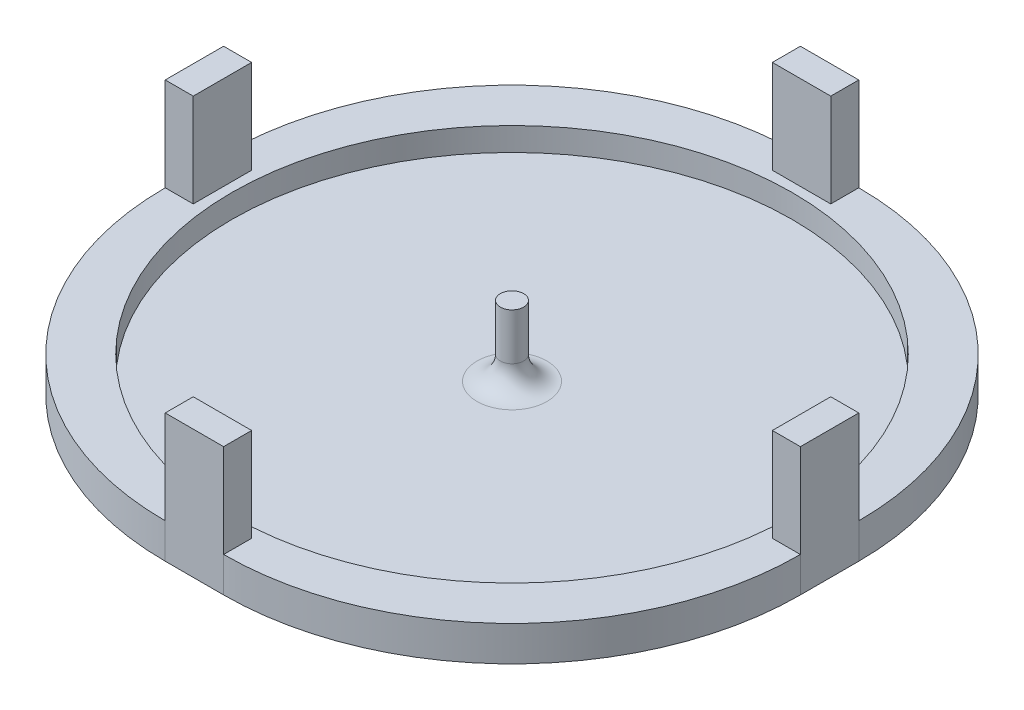
ISO-10303-21;
HEADER;
FILE_DESCRIPTION(('STEP AP214'),'2;1');
FILE_NAME('part.step','',(''),(''),'','','');
FILE_SCHEMA(('AUTOMOTIVE_DESIGN { 1 0 10303 214 1 1 1 1 }'));
ENDSEC;
DATA;
#1=APPLICATION_CONTEXT('core data for automotive mechanical design processes');
#2=APPLICATION_PROTOCOL_DEFINITION('international standard','automotive_design',2000,#1);
#3=PRODUCT_CONTEXT('',#1,'mechanical');
#4=PRODUCT('Part','Part','',(#3));
#5=PRODUCT_RELATED_PRODUCT_CATEGORY('part','',(#4));
#6=PRODUCT_DEFINITION_FORMATION('','',#4);
#7=PRODUCT_DEFINITION_CONTEXT('part definition',#1,'design');
#8=PRODUCT_DEFINITION('design','',#6,#7);
#9=PRODUCT_DEFINITION_SHAPE('','',#8);
#10=(LENGTH_UNIT() NAMED_UNIT(*) SI_UNIT(.MILLI.,.METRE.));
#11=(NAMED_UNIT(*) PLANE_ANGLE_UNIT() SI_UNIT($,.RADIAN.));
#12=(NAMED_UNIT(*) SI_UNIT($,.STERADIAN.) SOLID_ANGLE_UNIT());
#13=UNCERTAINTY_MEASURE_WITH_UNIT(LENGTH_MEASURE(1.E-05),#10,'distance_accuracy_value','');
#14=(GEOMETRIC_REPRESENTATION_CONTEXT(3) GLOBAL_UNCERTAINTY_ASSIGNED_CONTEXT((#13)) GLOBAL_UNIT_ASSIGNED_CONTEXT((#10,
#11,#12)) REPRESENTATION_CONTEXT('',''));
#15=CARTESIAN_POINT('',(0.,0.,0.));
#16=DIRECTION('',(0.,0.,1.));
#17=DIRECTION('',(1.,0.,0.));
#18=AXIS2_PLACEMENT_3D('',#15,#16,#17);
#19=CARTESIAN_POINT('',(-12.4,5.5,-1.3766765505352E-13));
#20=DIRECTION('',(1.,0.,0.));
#21=DIRECTION('',(0.,0.,-1.));
#22=AXIS2_PLACEMENT_3D('',#19,#20,#21);
#23=PLANE('',#22);
#24=DIRECTION('',(0.,0.,1.));
#25=VECTOR('',#24,1.);
#26=CARTESIAN_POINT('',(-12.4,1.5,-1.3766765505352E-13));
#27=LINE('',#26,#25);
#28=CARTESIAN_POINT('',(-12.4,1.5,-1.25));
#29=VERTEX_POINT('',#28);
#30=CARTESIAN_POINT('',(-12.4,1.5,1.25));
#31=VERTEX_POINT('',#30);
#32=EDGE_CURVE('E63',#29,#31,#27,.T.);
#33=ORIENTED_EDGE('',*,*,#32,.F.);
#34=DIRECTION('',(0.,-1.,0.));
#35=VECTOR('',#34,1.);
#36=CARTESIAN_POINT('',(-12.4,5.5,-1.25));
#37=LINE('',#36,#35);
#38=CARTESIAN_POINT('',(-12.4,5.5,-1.25));
#39=VERTEX_POINT('',#38);
#40=EDGE_CURVE('E429',#39,#29,#37,.T.);
#41=ORIENTED_EDGE('',*,*,#40,.F.);
#42=DIRECTION('',(0.,0.,1.));
#43=VECTOR('',#42,1.);
#44=CARTESIAN_POINT('',(-12.4,5.5,-1.3766765505352E-13));
#45=LINE('',#44,#43);
#46=CARTESIAN_POINT('',(-12.4,5.5,1.25));
#47=VERTEX_POINT('',#46);
#48=EDGE_CURVE('E401',#39,#47,#45,.T.);
#49=ORIENTED_EDGE('',*,*,#48,.T.);
#50=DIRECTION('',(0.,-1.,0.));
#51=VECTOR('',#50,1.);
#52=CARTESIAN_POINT('',(-12.4,5.5,1.25));
#53=LINE('',#52,#51);
#54=EDGE_CURVE('E416',#47,#31,#53,.T.);
#55=ORIENTED_EDGE('',*,*,#54,.T.);
#56=EDGE_LOOP('',(#33,#41,#49,#55));
#57=FACE_BOUND('',#56,.T.);
#58=ADVANCED_FACE('F47',(#57),#23,.T.);
#59=CARTESIAN_POINT('',(0.,5.5,-1.25));
#60=DIRECTION('',(0.,0.,-1.));
#61=DIRECTION('',(-1.,0.,0.));
#62=AXIS2_PLACEMENT_3D('',#59,#60,#61);
#63=PLANE('',#62);
#64=DIRECTION('',(1.,0.,0.));
#65=VECTOR('',#64,1.);
#66=CARTESIAN_POINT('',(0.,1.5,-1.25));
#67=LINE('',#66,#65);
#68=CARTESIAN_POINT('',(-13.6,1.5,-1.25));
#69=VERTEX_POINT('',#68);
#70=EDGE_CURVE('E70',#69,#29,#67,.T.);
#71=ORIENTED_EDGE('',*,*,#70,.F.);
#72=DIRECTION('',(0.,-1.,0.));
#73=VECTOR('',#72,1.);
#74=CARTESIAN_POINT('',(-13.6,5.5,-1.25));
#75=LINE('',#74,#73);
#76=CARTESIAN_POINT('',(-13.6,5.5,-1.25));
#77=VERTEX_POINT('',#76);
#78=EDGE_CURVE('E426',#77,#69,#75,.T.);
#79=ORIENTED_EDGE('',*,*,#78,.F.);
#80=DIRECTION('',(1.,0.,0.));
#81=VECTOR('',#80,1.);
#82=CARTESIAN_POINT('',(0.,5.5,-1.25));
#83=LINE('',#82,#81);
#84=EDGE_CURVE('E405',#77,#39,#83,.T.);
#85=ORIENTED_EDGE('',*,*,#84,.T.);
#86=ORIENTED_EDGE('',*,*,#40,.T.);
#87=EDGE_LOOP('',(#71,#79,#85,#86));
#88=FACE_BOUND('',#87,.T.);
#89=ADVANCED_FACE('F453',(#88),#63,.T.);
#90=CARTESIAN_POINT('',(-13.6,5.5,0.));
#91=DIRECTION('',(-1.,0.,0.));
#92=DIRECTION('',(0.,0.,1.));
#93=AXIS2_PLACEMENT_3D('',#90,#91,#92);
#94=PLANE('',#93);
#95=DIRECTION('',(0.,0.,-1.));
#96=VECTOR('',#95,1.);
#97=CARTESIAN_POINT('',(-13.6,0.,0.));
#98=LINE('',#97,#96);
#99=CARTESIAN_POINT('',(-13.6,0.,1.25));
#100=VERTEX_POINT('',#99);
#101=CARTESIAN_POINT('',(-13.6,0.,-1.25));
#102=VERTEX_POINT('',#101);
#103=EDGE_CURVE('E400',#100,#102,#98,.T.);
#104=ORIENTED_EDGE('',*,*,#103,.F.);
#105=DIRECTION('',(0.,-1.,0.));
#106=VECTOR('',#105,1.);
#107=CARTESIAN_POINT('',(-13.6,1.5,1.25));
#108=LINE('',#107,#106);
#109=CARTESIAN_POINT('',(-13.6,1.5,1.25));
#110=VERTEX_POINT('',#109);
#111=EDGE_CURVE('E382',#110,#100,#108,.T.);
#112=ORIENTED_EDGE('',*,*,#111,.F.);
#113=DIRECTION('',(0.,-1.,0.));
#114=VECTOR('',#113,1.);
#115=CARTESIAN_POINT('',(-13.6,5.5,1.25));
#116=LINE('',#115,#114);
#117=CARTESIAN_POINT('',(-13.6,5.5,1.25));
#118=VERTEX_POINT('',#117);
#119=EDGE_CURVE('E422',#118,#110,#116,.T.);
#120=ORIENTED_EDGE('',*,*,#119,.F.);
#121=DIRECTION('',(0.,0.,-1.));
#122=VECTOR('',#121,1.);
#123=CARTESIAN_POINT('',(-13.6,5.5,0.));
#124=LINE('',#123,#122);
#125=EDGE_CURVE('E409',#118,#77,#124,.T.);
#126=ORIENTED_EDGE('',*,*,#125,.T.);
#127=ORIENTED_EDGE('',*,*,#78,.T.);
#128=DIRECTION('',(0.,-1.,0.));
#129=VECTOR('',#128,1.);
#130=CARTESIAN_POINT('',(-13.6,1.5,-1.25));
#131=LINE('',#130,#129);
#132=EDGE_CURVE('E386',#69,#102,#131,.T.);
#133=ORIENTED_EDGE('',*,*,#132,.T.);
#134=EDGE_LOOP('',(#104,#112,#120,#126,#127,#133));
#135=FACE_BOUND('',#134,.T.);
#136=ADVANCED_FACE('F458',(#135),#94,.T.);
#137=CARTESIAN_POINT('',(0.,5.5,1.25));
#138=DIRECTION('',(0.,0.,-1.));
#139=DIRECTION('',(-1.,0.,0.));
#140=AXIS2_PLACEMENT_3D('',#137,#138,#139);
#141=PLANE('',#140);
#142=ORIENTED_EDGE('',*,*,#119,.T.);
#143=DIRECTION('',(1.,0.,0.));
#144=VECTOR('',#143,1.);
#145=CARTESIAN_POINT('',(0.,1.5,1.25));
#146=LINE('',#145,#144);
#147=EDGE_CURVE('E334',#110,#31,#146,.T.);
#148=ORIENTED_EDGE('',*,*,#147,.T.);
#149=ORIENTED_EDGE('',*,*,#54,.F.);
#150=DIRECTION('',(1.,0.,0.));
#151=VECTOR('',#150,1.);
#152=CARTESIAN_POINT('',(0.,5.5,1.25));
#153=LINE('',#152,#151);
#154=EDGE_CURVE('E413',#118,#47,#153,.T.);
#155=ORIENTED_EDGE('',*,*,#154,.F.);
#156=EDGE_LOOP('',(#142,#148,#149,#155));
#157=FACE_BOUND('',#156,.T.);
#158=ADVANCED_FACE('F463',(#157),#141,.F.);
#159=CARTESIAN_POINT('',(0.,5.5,0.));
#160=DIRECTION('',(0.,1.,0.));
#161=DIRECTION('',(0.,0.,1.));
#162=AXIS2_PLACEMENT_3D('',#159,#160,#161);
#163=PLANE('',#162);
#164=ORIENTED_EDGE('',*,*,#48,.F.);
#165=ORIENTED_EDGE('',*,*,#84,.F.);
#166=ORIENTED_EDGE('',*,*,#125,.F.);
#167=ORIENTED_EDGE('',*,*,#154,.T.);
#168=EDGE_LOOP('',(#164,#165,#166,#167));
#169=FACE_BOUND('',#168,.T.);
#170=ADVANCED_FACE('F467',(#169),#163,.T.);
#171=CARTESIAN_POINT('',(0.,0.,0.));
#172=DIRECTION('',(0.,1.,0.));
#173=DIRECTION('',(0.,0.,1.));
#174=AXIS2_PLACEMENT_3D('',#171,#172,#173);
#175=PLANE('',#174);
#176=DIRECTION('',(1.,0.,0.));
#177=VECTOR('',#176,1.);
#178=CARTESIAN_POINT('',(0.,0.,13.6));
#179=LINE('',#178,#177);
#180=CARTESIAN_POINT('',(-1.25,0.,13.6));
#181=VERTEX_POINT('',#180);
#182=CARTESIAN_POINT('',(1.25,0.,13.6));
#183=VERTEX_POINT('',#182);
#184=EDGE_CURVE('E214',#181,#183,#179,.T.);
#185=ORIENTED_EDGE('',*,*,#184,.F.);
#186=CARTESIAN_POINT('',(-1.25000000000003,0.,1.25000000000002));
#187=DIRECTION('',(0.,1.,0.));
#188=DIRECTION('',(0.,0.,1.));
#189=AXIS2_PLACEMENT_3D('',#186,#187,#188);
#190=CIRCLE('',#189,12.35);
#191=EDGE_CURVE('E366',#100,#181,#190,.T.);
#192=ORIENTED_EDGE('',*,*,#191,.F.);
#193=ORIENTED_EDGE('',*,*,#103,.T.);
#194=CARTESIAN_POINT('',(-1.24999999999999,0.,-1.24999999999999));
#195=DIRECTION('',(0.,1.,0.));
#196=DIRECTION('',(0.,0.,1.));
#197=AXIS2_PLACEMENT_3D('',#194,#195,#196);
#198=CIRCLE('',#197,12.35);
#199=CARTESIAN_POINT('',(-1.25,0.,-13.6));
#200=VERTEX_POINT('',#199);
#201=EDGE_CURVE('E362',#102,#200,#198,.F.);
#202=ORIENTED_EDGE('',*,*,#201,.T.);
#203=DIRECTION('',(1.,0.,0.));
#204=VECTOR('',#203,1.);
#205=CARTESIAN_POINT('',(0.,0.,-13.6));
#206=LINE('',#205,#204);
#207=CARTESIAN_POINT('',(1.24999999999999,0.,-13.6));
#208=VERTEX_POINT('',#207);
#209=EDGE_CURVE('E264',#200,#208,#206,.T.);
#210=ORIENTED_EDGE('',*,*,#209,.T.);
#211=CARTESIAN_POINT('',(1.24999999999997,0.,-1.24999999999996));
#212=DIRECTION('',(0.,1.,0.));
#213=DIRECTION('',(0.,0.,1.));
#214=AXIS2_PLACEMENT_3D('',#211,#212,#213);
#215=CIRCLE('',#214,12.35);
#216=CARTESIAN_POINT('',(13.6,0.,-1.25));
#217=VERTEX_POINT('',#216);
#218=EDGE_CURVE('E299',#208,#217,#215,.F.);
#219=ORIENTED_EDGE('',*,*,#218,.T.);
#220=DIRECTION('',(0.,0.,-1.));
#221=VECTOR('',#220,1.);
#222=CARTESIAN_POINT('',(13.6,0.,0.));
#223=LINE('',#222,#221);
#224=CARTESIAN_POINT('',(13.6,0.,1.25));
#225=VERTEX_POINT('',#224);
#226=EDGE_CURVE('E198',#225,#217,#223,.T.);
#227=ORIENTED_EDGE('',*,*,#226,.F.);
#228=CARTESIAN_POINT('',(1.24999999999999,0.,1.24999999999999));
#229=DIRECTION('',(0.,1.,0.));
#230=DIRECTION('',(0.,0.,1.));
#231=AXIS2_PLACEMENT_3D('',#228,#229,#230);
#232=CIRCLE('',#231,12.35);
#233=EDGE_CURVE('E304',#225,#183,#232,.F.);
#234=ORIENTED_EDGE('',*,*,#233,.T.);
#235=EDGE_LOOP('',(#185,#192,#193,#202,#210,#219,#227,#234));
#236=FACE_BOUND('',#235,.T.);
#237=ADVANCED_FACE('F469',(#236),#175,.F.);
#238=CARTESIAN_POINT('',(1.24999999999997,1.5,-1.24999999999996));
#239=DIRECTION('',(0.,-1.,0.));
#240=DIRECTION('',(0.,0.,-1.));
#241=AXIS2_PLACEMENT_3D('',#238,#239,#240);
#242=CYLINDRICAL_SURFACE('',#241,12.35);
#243=ORIENTED_EDGE('',*,*,#218,.F.);
#244=DIRECTION('',(0.,-1.,0.));
#245=VECTOR('',#244,1.);
#246=CARTESIAN_POINT('',(1.24999999999999,1.5,-13.6));
#247=LINE('',#246,#245);
#248=CARTESIAN_POINT('',(1.24999999999999,1.5,-13.6));
#249=VERTEX_POINT('',#248);
#250=EDGE_CURVE('E392',#249,#208,#247,.T.);
#251=ORIENTED_EDGE('',*,*,#250,.F.);
#252=CARTESIAN_POINT('',(1.24999999999997,1.5,-1.24999999999996));
#253=DIRECTION('',(0.,1.,0.));
#254=DIRECTION('',(0.,0.,1.));
#255=AXIS2_PLACEMENT_3D('',#252,#253,#254);
#256=CIRCLE('',#255,12.35);
#257=CARTESIAN_POINT('',(13.6,1.5,-1.25));
#258=VERTEX_POINT('',#257);
#259=EDGE_CURVE('E312',#249,#258,#256,.F.);
#260=ORIENTED_EDGE('',*,*,#259,.T.);
#261=DIRECTION('',(0.,-1.,0.));
#262=VECTOR('',#261,1.);
#263=CARTESIAN_POINT('',(13.6,1.5,-1.25));
#264=LINE('',#263,#262);
#265=EDGE_CURVE('E396',#258,#217,#264,.T.);
#266=ORIENTED_EDGE('',*,*,#265,.T.);
#267=EDGE_LOOP('',(#243,#251,#260,#266));
#268=FACE_BOUND('',#267,.T.);
#269=ADVANCED_FACE('F472',(#268),#242,.T.);
#270=CARTESIAN_POINT('',(-1.24999999999999,1.5,-1.24999999999999));
#271=DIRECTION('',(0.,-1.,0.));
#272=DIRECTION('',(0.,0.,-1.));
#273=AXIS2_PLACEMENT_3D('',#270,#271,#272);
#274=CYLINDRICAL_SURFACE('',#273,12.35);
#275=ORIENTED_EDGE('',*,*,#201,.F.);
#276=ORIENTED_EDGE('',*,*,#132,.F.);
#277=CARTESIAN_POINT('',(-1.24999999999999,1.5,-1.24999999999999));
#278=DIRECTION('',(0.,1.,0.));
#279=DIRECTION('',(0.,0.,1.));
#280=AXIS2_PLACEMENT_3D('',#277,#278,#279);
#281=CIRCLE('',#280,12.35);
#282=CARTESIAN_POINT('',(-1.25,1.5,-13.6));
#283=VERTEX_POINT('',#282);
#284=EDGE_CURVE('E326',#69,#283,#281,.F.);
#285=ORIENTED_EDGE('',*,*,#284,.T.);
#286=DIRECTION('',(0.,-1.,0.));
#287=VECTOR('',#286,1.);
#288=CARTESIAN_POINT('',(-1.25,1.5,-13.6));
#289=LINE('',#288,#287);
#290=EDGE_CURVE('E389',#283,#200,#289,.T.);
#291=ORIENTED_EDGE('',*,*,#290,.T.);
#292=EDGE_LOOP('',(#275,#276,#285,#291));
#293=FACE_BOUND('',#292,.T.);
#294=ADVANCED_FACE('F478',(#293),#274,.T.);
#295=CARTESIAN_POINT('',(-1.25000000000003,1.5,1.25000000000002));
#296=DIRECTION('',(0.,-1.,0.));
#297=DIRECTION('',(0.,0.,-1.));
#298=AXIS2_PLACEMENT_3D('',#295,#296,#297);
#299=CYLINDRICAL_SURFACE('',#298,12.35);
#300=ORIENTED_EDGE('',*,*,#191,.T.);
#301=DIRECTION('',(0.,-1.,0.));
#302=VECTOR('',#301,1.);
#303=CARTESIAN_POINT('',(-1.25,1.5,13.6));
#304=LINE('',#303,#302);
#305=CARTESIAN_POINT('',(-1.25,1.5,13.6));
#306=VERTEX_POINT('',#305);
#307=EDGE_CURVE('E379',#306,#181,#304,.T.);
#308=ORIENTED_EDGE('',*,*,#307,.F.);
#309=CARTESIAN_POINT('',(-1.25000000000003,1.5,1.25000000000002));
#310=DIRECTION('',(0.,1.,0.));
#311=DIRECTION('',(0.,0.,1.));
#312=AXIS2_PLACEMENT_3D('',#309,#310,#311);
#313=CIRCLE('',#312,12.35);
#314=EDGE_CURVE('E337',#110,#306,#313,.T.);
#315=ORIENTED_EDGE('',*,*,#314,.F.);
#316=ORIENTED_EDGE('',*,*,#111,.T.);
#317=EDGE_LOOP('',(#300,#308,#315,#316));
#318=FACE_BOUND('',#317,.T.);
#319=ADVANCED_FACE('F482',(#318),#299,.T.);
#320=CARTESIAN_POINT('',(1.24999999999999,1.5,1.24999999999999));
#321=DIRECTION('',(0.,-1.,0.));
#322=DIRECTION('',(0.,0.,-1.));
#323=AXIS2_PLACEMENT_3D('',#320,#321,#322);
#324=CYLINDRICAL_SURFACE('',#323,12.35);
#325=ORIENTED_EDGE('',*,*,#233,.F.);
#326=DIRECTION('',(0.,-1.,0.));
#327=VECTOR('',#326,1.);
#328=CARTESIAN_POINT('',(13.6,1.5,1.25));
#329=LINE('',#328,#327);
#330=CARTESIAN_POINT('',(13.6,1.5,1.25));
#331=VERTEX_POINT('',#330);
#332=EDGE_CURVE('E358',#331,#225,#329,.T.);
#333=ORIENTED_EDGE('',*,*,#332,.F.);
#334=CARTESIAN_POINT('',(1.24999999999999,1.5,1.24999999999999));
#335=DIRECTION('',(0.,1.,0.));
#336=DIRECTION('',(0.,0.,1.));
#337=AXIS2_PLACEMENT_3D('',#334,#335,#336);
#338=CIRCLE('',#337,12.35);
#339=CARTESIAN_POINT('',(1.25,1.5,13.6));
#340=VERTEX_POINT('',#339);
#341=EDGE_CURVE('E350',#331,#340,#338,.F.);
#342=ORIENTED_EDGE('',*,*,#341,.T.);
#343=DIRECTION('',(0.,-1.,0.));
#344=VECTOR('',#343,1.);
#345=CARTESIAN_POINT('',(1.25,1.5,13.6));
#346=LINE('',#345,#344);
#347=EDGE_CURVE('E375',#340,#183,#346,.T.);
#348=ORIENTED_EDGE('',*,*,#347,.T.);
#349=EDGE_LOOP('',(#325,#333,#342,#348));
#350=FACE_BOUND('',#349,.T.);
#351=ADVANCED_FACE('F486',(#350),#324,.T.);
#352=CARTESIAN_POINT('',(0.,1.5,0.));
#353=DIRECTION('',(0.,-1.,0.));
#354=DIRECTION('',(0.,0.,-1.));
#355=AXIS2_PLACEMENT_3D('',#352,#353,#354);
#356=CYLINDRICAL_SURFACE('',#355,12.);
#357=CARTESIAN_POINT('',(0.,0.5,0.));
#358=DIRECTION('',(0.,1.,0.));
#359=DIRECTION('',(0.,0.,1.));
#360=AXIS2_PLACEMENT_3D('',#357,#358,#359);
#361=CIRCLE('',#360,12.);
#362=CARTESIAN_POINT('',(0.,0.5,12.));
#363=VERTEX_POINT('',#362);
#364=EDGE_CURVE('E432',#363,#363,#361,.T.);
#365=ORIENTED_EDGE('',*,*,#364,.F.);
#366=EDGE_LOOP('',(#365));
#367=FACE_BOUND('',#366,.T.);
#368=CARTESIAN_POINT('',(0.,1.5,0.));
#369=DIRECTION('',(0.,1.,0.));
#370=DIRECTION('',(0.,0.,1.));
#371=AXIS2_PLACEMENT_3D('',#368,#369,#370);
#372=CIRCLE('',#371,12.);
#373=CARTESIAN_POINT('',(0.,1.5,12.));
#374=VERTEX_POINT('',#373);
#375=EDGE_CURVE('E354',#374,#374,#372,.T.);
#376=ORIENTED_EDGE('',*,*,#375,.T.);
#377=EDGE_LOOP('',(#376));
#378=FACE_BOUND('',#377,.T.);
#379=ADVANCED_FACE('F490',(#367,#378),#356,.F.);
#380=CARTESIAN_POINT('',(0.,1.5,0.));
#381=DIRECTION('',(0.,1.,0.));
#382=DIRECTION('',(0.,0.,1.));
#383=AXIS2_PLACEMENT_3D('',#380,#381,#382);
#384=PLANE('',#383);
#385=DIRECTION('',(1.,0.,0.));
#386=VECTOR('',#385,1.);
#387=CARTESIAN_POINT('',(0.,1.5,1.25));
#388=LINE('',#387,#386);
#389=CARTESIAN_POINT('',(12.4,1.5,1.25));
#390=VERTEX_POINT('',#389);
#391=EDGE_CURVE('E300',#390,#331,#388,.T.);
#392=ORIENTED_EDGE('',*,*,#391,.F.);
#393=DIRECTION('',(0.,0.,-1.));
#394=VECTOR('',#393,1.);
#395=CARTESIAN_POINT('',(12.4,1.5,0.));
#396=LINE('',#395,#394);
#397=CARTESIAN_POINT('',(12.4,1.5,-1.25));
#398=VERTEX_POINT('',#397);
#399=EDGE_CURVE('E303',#390,#398,#396,.T.);
#400=ORIENTED_EDGE('',*,*,#399,.T.);
#401=DIRECTION('',(1.,0.,0.));
#402=VECTOR('',#401,1.);
#403=CARTESIAN_POINT('',(0.,1.5,-1.25));
#404=LINE('',#403,#402);
#405=EDGE_CURVE('E308',#398,#258,#404,.T.);
#406=ORIENTED_EDGE('',*,*,#405,.T.);
#407=ORIENTED_EDGE('',*,*,#259,.F.);
#408=DIRECTION('',(0.,0.,1.));
#409=VECTOR('',#408,1.);
#410=CARTESIAN_POINT('',(1.24999999999999,1.5,0.));
#411=LINE('',#410,#409);
#412=CARTESIAN_POINT('',(1.24999999999999,1.5,-12.4));
#413=VERTEX_POINT('',#412);
#414=EDGE_CURVE('E316',#249,#413,#411,.T.);
#415=ORIENTED_EDGE('',*,*,#414,.T.);
#416=DIRECTION('',(-1.,0.,0.));
#417=VECTOR('',#416,1.);
#418=CARTESIAN_POINT('',(0.,1.5,-12.4));
#419=LINE('',#418,#417);
#420=CARTESIAN_POINT('',(-1.25,1.5,-12.4));
#421=VERTEX_POINT('',#420);
#422=EDGE_CURVE('E319',#413,#421,#419,.T.);
#423=ORIENTED_EDGE('',*,*,#422,.T.);
#424=DIRECTION('',(0.,0.,1.));
#425=VECTOR('',#424,1.);
#426=CARTESIAN_POINT('',(-1.25,1.5,0.));
#427=LINE('',#426,#425);
#428=EDGE_CURVE('E322',#283,#421,#427,.T.);
#429=ORIENTED_EDGE('',*,*,#428,.F.);
#430=ORIENTED_EDGE('',*,*,#284,.F.);
#431=ORIENTED_EDGE('',*,*,#70,.T.);
#432=ORIENTED_EDGE('',*,*,#32,.T.);
#433=ORIENTED_EDGE('',*,*,#147,.F.);
#434=ORIENTED_EDGE('',*,*,#314,.T.);
#435=DIRECTION('',(0.,0.,1.));
#436=VECTOR('',#435,1.);
#437=CARTESIAN_POINT('',(-1.25,1.5,0.));
#438=LINE('',#437,#436);
#439=CARTESIAN_POINT('',(-1.25,1.5,12.4));
#440=VERTEX_POINT('',#439);
#441=EDGE_CURVE('E341',#440,#306,#438,.T.);
#442=ORIENTED_EDGE('',*,*,#441,.F.);
#443=DIRECTION('',(1.,0.,0.));
#444=VECTOR('',#443,1.);
#445=CARTESIAN_POINT('',(0.,1.5,12.4));
#446=LINE('',#445,#444);
#447=CARTESIAN_POINT('',(1.25,1.5,12.4));
#448=VERTEX_POINT('',#447);
#449=EDGE_CURVE('E194',#440,#448,#446,.T.);
#450=ORIENTED_EDGE('',*,*,#449,.T.);
#451=DIRECTION('',(0.,0.,1.));
#452=VECTOR('',#451,1.);
#453=CARTESIAN_POINT('',(1.24999999999999,1.5,0.));
#454=LINE('',#453,#452);
#455=EDGE_CURVE('E346',#448,#340,#454,.T.);
#456=ORIENTED_EDGE('',*,*,#455,.T.);
#457=ORIENTED_EDGE('',*,*,#341,.F.);
#458=EDGE_LOOP('',(#392,#400,#406,#407,#415,#423,#429,#430,#431,#432,#433,#434,#442,#450,#456,#457));
#459=FACE_BOUND('',#458,.T.);
#460=ORIENTED_EDGE('',*,*,#375,.F.);
#461=EDGE_LOOP('',(#460));
#462=FACE_BOUND('',#461,.T.);
#463=ADVANCED_FACE('F494',(#459,#462),#384,.T.);
#464=CARTESIAN_POINT('',(0.,5.5,-12.4));
#465=DIRECTION('',(0.,0.,1.));
#466=DIRECTION('',(1.,0.,0.));
#467=AXIS2_PLACEMENT_3D('',#464,#465,#466);
#468=PLANE('',#467);
#469=DIRECTION('',(0.,-1.,0.));
#470=VECTOR('',#469,1.);
#471=CARTESIAN_POINT('',(-1.25,5.5,-12.4));
#472=LINE('',#471,#470);
#473=CARTESIAN_POINT('',(-1.25,5.5,-12.4));
#474=VERTEX_POINT('',#473);
#475=EDGE_CURVE('E280',#474,#421,#472,.T.);
#476=ORIENTED_EDGE('',*,*,#475,.T.);
#477=ORIENTED_EDGE('',*,*,#422,.F.);
#478=DIRECTION('',(0.,-1.,0.));
#479=VECTOR('',#478,1.);
#480=CARTESIAN_POINT('',(1.24999999999999,5.5,-12.4));
#481=LINE('',#480,#479);
#482=CARTESIAN_POINT('',(1.24999999999999,5.5,-12.4));
#483=VERTEX_POINT('',#482);
#484=EDGE_CURVE('E295',#483,#413,#481,.T.);
#485=ORIENTED_EDGE('',*,*,#484,.F.);
#486=DIRECTION('',(-1.,0.,0.));
#487=VECTOR('',#486,1.);
#488=CARTESIAN_POINT('',(0.,5.5,-12.4));
#489=LINE('',#488,#487);
#490=EDGE_CURVE('E265',#483,#474,#489,.T.);
#491=ORIENTED_EDGE('',*,*,#490,.T.);
#492=EDGE_LOOP('',(#476,#477,#485,#491));
#493=FACE_BOUND('',#492,.T.);
#494=ADVANCED_FACE('F498',(#493),#468,.T.);
#495=CARTESIAN_POINT('',(1.24999999999999,5.5,0.));
#496=DIRECTION('',(1.,0.,0.));
#497=DIRECTION('',(0.,0.,-1.));
#498=AXIS2_PLACEMENT_3D('',#495,#496,#497);
#499=PLANE('',#498);
#500=ORIENTED_EDGE('',*,*,#484,.T.);
#501=ORIENTED_EDGE('',*,*,#414,.F.);
#502=DIRECTION('',(0.,-1.,0.));
#503=VECTOR('',#502,1.);
#504=CARTESIAN_POINT('',(1.24999999999999,5.5,-13.6));
#505=LINE('',#504,#503);
#506=CARTESIAN_POINT('',(1.24999999999999,5.5,-13.6));
#507=VERTEX_POINT('',#506);
#508=EDGE_CURVE('E291',#507,#249,#505,.T.);
#509=ORIENTED_EDGE('',*,*,#508,.F.);
#510=DIRECTION('',(0.,0.,1.));
#511=VECTOR('',#510,1.);
#512=CARTESIAN_POINT('',(1.24999999999999,5.5,0.));
#513=LINE('',#512,#511);
#514=EDGE_CURVE('E269',#507,#483,#513,.T.);
#515=ORIENTED_EDGE('',*,*,#514,.T.);
#516=EDGE_LOOP('',(#500,#501,#509,#515));
#517=FACE_BOUND('',#516,.T.);
#518=ADVANCED_FACE('F502',(#517),#499,.T.);
#519=CARTESIAN_POINT('',(0.,5.5,-13.6));
#520=DIRECTION('',(0.,0.,-1.));
#521=DIRECTION('',(-1.,0.,0.));
#522=AXIS2_PLACEMENT_3D('',#519,#520,#521);
#523=PLANE('',#522);
#524=ORIENTED_EDGE('',*,*,#209,.F.);
#525=ORIENTED_EDGE('',*,*,#290,.F.);
#526=DIRECTION('',(0.,-1.,0.));
#527=VECTOR('',#526,1.);
#528=CARTESIAN_POINT('',(-1.25,5.5,-13.6));
#529=LINE('',#528,#527);
#530=CARTESIAN_POINT('',(-1.25,5.5,-13.6));
#531=VERTEX_POINT('',#530);
#532=EDGE_CURVE('E287',#531,#283,#529,.T.);
#533=ORIENTED_EDGE('',*,*,#532,.F.);
#534=DIRECTION('',(1.,0.,0.));
#535=VECTOR('',#534,1.);
#536=CARTESIAN_POINT('',(0.,5.5,-13.6));
#537=LINE('',#536,#535);
#538=EDGE_CURVE('E273',#531,#507,#537,.T.);
#539=ORIENTED_EDGE('',*,*,#538,.T.);
#540=ORIENTED_EDGE('',*,*,#508,.T.);
#541=ORIENTED_EDGE('',*,*,#250,.T.);
#542=EDGE_LOOP('',(#524,#525,#533,#539,#540,#541));
#543=FACE_BOUND('',#542,.T.);
#544=ADVANCED_FACE('F506',(#543),#523,.T.);
#545=CARTESIAN_POINT('',(-1.25,5.5,0.));
#546=DIRECTION('',(1.,0.,0.));
#547=DIRECTION('',(0.,0.,-1.));
#548=AXIS2_PLACEMENT_3D('',#545,#546,#547);
#549=PLANE('',#548);
#550=ORIENTED_EDGE('',*,*,#428,.T.);
#551=ORIENTED_EDGE('',*,*,#475,.F.);
#552=DIRECTION('',(0.,0.,1.));
#553=VECTOR('',#552,1.);
#554=CARTESIAN_POINT('',(-1.25,5.5,0.));
#555=LINE('',#554,#553);
#556=EDGE_CURVE('E277',#531,#474,#555,.T.);
#557=ORIENTED_EDGE('',*,*,#556,.F.);
#558=ORIENTED_EDGE('',*,*,#532,.T.);
#559=EDGE_LOOP('',(#550,#551,#557,#558));
#560=FACE_BOUND('',#559,.T.);
#561=ADVANCED_FACE('F510',(#560),#549,.F.);
#562=CARTESIAN_POINT('',(0.,5.5,0.));
#563=DIRECTION('',(0.,1.,0.));
#564=DIRECTION('',(0.,0.,1.));
#565=AXIS2_PLACEMENT_3D('',#562,#563,#564);
#566=PLANE('',#565);
#567=ORIENTED_EDGE('',*,*,#490,.F.);
#568=ORIENTED_EDGE('',*,*,#514,.F.);
#569=ORIENTED_EDGE('',*,*,#538,.F.);
#570=ORIENTED_EDGE('',*,*,#556,.T.);
#571=EDGE_LOOP('',(#567,#568,#569,#570));
#572=FACE_BOUND('',#571,.T.);
#573=ADVANCED_FACE('F514',(#572),#566,.T.);
#574=CARTESIAN_POINT('',(12.4,5.5,0.));
#575=DIRECTION('',(-1.,0.,0.));
#576=DIRECTION('',(0.,0.,1.));
#577=AXIS2_PLACEMENT_3D('',#574,#575,#576);
#578=PLANE('',#577);
#579=DIRECTION('',(0.,-1.,0.));
#580=VECTOR('',#579,1.);
#581=CARTESIAN_POINT('',(12.4,5.5,-1.25));
#582=LINE('',#581,#580);
#583=CARTESIAN_POINT('',(12.4,5.5,-1.25));
#584=VERTEX_POINT('',#583);
#585=EDGE_CURVE('E247',#584,#398,#582,.T.);
#586=ORIENTED_EDGE('',*,*,#585,.T.);
#587=ORIENTED_EDGE('',*,*,#399,.F.);
#588=DIRECTION('',(0.,-1.,0.));
#589=VECTOR('',#588,1.);
#590=CARTESIAN_POINT('',(12.4,5.5,1.25));
#591=LINE('',#590,#589);
#592=CARTESIAN_POINT('',(12.4,5.5,1.25));
#593=VERTEX_POINT('',#592);
#594=EDGE_CURVE('E260',#593,#390,#591,.T.);
#595=ORIENTED_EDGE('',*,*,#594,.F.);
#596=DIRECTION('',(0.,0.,-1.));
#597=VECTOR('',#596,1.);
#598=CARTESIAN_POINT('',(12.4,5.5,0.));
#599=LINE('',#598,#597);
#600=EDGE_CURVE('E233',#593,#584,#599,.T.);
#601=ORIENTED_EDGE('',*,*,#600,.T.);
#602=EDGE_LOOP('',(#586,#587,#595,#601));
#603=FACE_BOUND('',#602,.T.);
#604=ADVANCED_FACE('F518',(#603),#578,.T.);
#605=CARTESIAN_POINT('',(0.,5.5,1.25));
#606=DIRECTION('',(0.,0.,-1.));
#607=DIRECTION('',(-1.,0.,0.));
#608=AXIS2_PLACEMENT_3D('',#605,#606,#607);
#609=PLANE('',#608);
#610=ORIENTED_EDGE('',*,*,#391,.T.);
#611=DIRECTION('',(0.,-1.,0.));
#612=VECTOR('',#611,1.);
#613=CARTESIAN_POINT('',(13.6,5.5,1.25));
#614=LINE('',#613,#612);
#615=CARTESIAN_POINT('',(13.6,5.5,1.25));
#616=VERTEX_POINT('',#615);
#617=EDGE_CURVE('E256',#616,#331,#614,.T.);
#618=ORIENTED_EDGE('',*,*,#617,.F.);
#619=DIRECTION('',(1.,0.,0.));
#620=VECTOR('',#619,1.);
#621=CARTESIAN_POINT('',(0.,5.5,1.25));
#622=LINE('',#621,#620);
#623=EDGE_CURVE('E237',#593,#616,#622,.T.);
#624=ORIENTED_EDGE('',*,*,#623,.F.);
#625=ORIENTED_EDGE('',*,*,#594,.T.);
#626=EDGE_LOOP('',(#610,#618,#624,#625));
#627=FACE_BOUND('',#626,.T.);
#628=ADVANCED_FACE('F522',(#627),#609,.F.);
#629=CARTESIAN_POINT('',(13.6,5.5,0.));
#630=DIRECTION('',(-1.,0.,0.));
#631=DIRECTION('',(0.,0.,1.));
#632=AXIS2_PLACEMENT_3D('',#629,#630,#631);
#633=PLANE('',#632);
#634=ORIENTED_EDGE('',*,*,#226,.T.);
#635=ORIENTED_EDGE('',*,*,#265,.F.);
#636=DIRECTION('',(0.,-1.,0.));
#637=VECTOR('',#636,1.);
#638=CARTESIAN_POINT('',(13.6,5.5,-1.25));
#639=LINE('',#638,#637);
#640=CARTESIAN_POINT('',(13.6,5.5,-1.25));
#641=VERTEX_POINT('',#640);
#642=EDGE_CURVE('E253',#641,#258,#639,.T.);
#643=ORIENTED_EDGE('',*,*,#642,.F.);
#644=DIRECTION('',(0.,0.,-1.));
#645=VECTOR('',#644,1.);
#646=CARTESIAN_POINT('',(13.6,5.5,0.));
#647=LINE('',#646,#645);
#648=EDGE_CURVE('E240',#616,#641,#647,.T.);
#649=ORIENTED_EDGE('',*,*,#648,.F.);
#650=ORIENTED_EDGE('',*,*,#617,.T.);
#651=ORIENTED_EDGE('',*,*,#332,.T.);
#652=EDGE_LOOP('',(#634,#635,#643,#649,#650,#651));
#653=FACE_BOUND('',#652,.T.);
#654=ADVANCED_FACE('F526',(#653),#633,.F.);
#655=CARTESIAN_POINT('',(0.,5.5,-1.25));
#656=DIRECTION('',(0.,0.,-1.));
#657=DIRECTION('',(-1.,0.,0.));
#658=AXIS2_PLACEMENT_3D('',#655,#656,#657);
#659=PLANE('',#658);
#660=ORIENTED_EDGE('',*,*,#642,.T.);
#661=ORIENTED_EDGE('',*,*,#405,.F.);
#662=ORIENTED_EDGE('',*,*,#585,.F.);
#663=DIRECTION('',(1.,0.,0.));
#664=VECTOR('',#663,1.);
#665=CARTESIAN_POINT('',(0.,5.5,-1.25));
#666=LINE('',#665,#664);
#667=EDGE_CURVE('E243',#584,#641,#666,.T.);
#668=ORIENTED_EDGE('',*,*,#667,.T.);
#669=EDGE_LOOP('',(#660,#661,#662,#668));
#670=FACE_BOUND('',#669,.T.);
#671=ADVANCED_FACE('F530',(#670),#659,.T.);
#672=CARTESIAN_POINT('',(0.,5.5,0.));
#673=DIRECTION('',(0.,1.,0.));
#674=DIRECTION('',(0.,0.,1.));
#675=AXIS2_PLACEMENT_3D('',#672,#673,#674);
#676=PLANE('',#675);
#677=ORIENTED_EDGE('',*,*,#600,.F.);
#678=ORIENTED_EDGE('',*,*,#623,.T.);
#679=ORIENTED_EDGE('',*,*,#648,.T.);
#680=ORIENTED_EDGE('',*,*,#667,.F.);
#681=EDGE_LOOP('',(#677,#678,#679,#680));
#682=FACE_BOUND('',#681,.T.);
#683=ADVANCED_FACE('F534',(#682),#676,.T.);
#684=CARTESIAN_POINT('',(0.,5.5,12.4));
#685=DIRECTION('',(0.,0.,-1.));
#686=DIRECTION('',(-1.,0.,0.));
#687=AXIS2_PLACEMENT_3D('',#684,#685,#686);
#688=PLANE('',#687);
#689=DIRECTION('',(0.,-1.,0.));
#690=VECTOR('',#689,1.);
#691=CARTESIAN_POINT('',(1.25,5.5,12.4));
#692=LINE('',#691,#690);
#693=CARTESIAN_POINT('',(1.25,5.5,12.4));
#694=VERTEX_POINT('',#693);
#695=EDGE_CURVE('E224',#694,#448,#692,.T.);
#696=ORIENTED_EDGE('',*,*,#695,.T.);
#697=ORIENTED_EDGE('',*,*,#449,.F.);
#698=DIRECTION('',(0.,-1.,0.));
#699=VECTOR('',#698,1.);
#700=CARTESIAN_POINT('',(-1.25,5.5,12.4));
#701=LINE('',#700,#699);
#702=CARTESIAN_POINT('',(-1.25,5.5,12.4));
#703=VERTEX_POINT('',#702);
#704=EDGE_CURVE('E186',#703,#440,#701,.T.);
#705=ORIENTED_EDGE('',*,*,#704,.F.);
#706=DIRECTION('',(1.,0.,0.));
#707=VECTOR('',#706,1.);
#708=CARTESIAN_POINT('',(0.,5.5,12.4));
#709=LINE('',#708,#707);
#710=EDGE_CURVE('E191',#703,#694,#709,.T.);
#711=ORIENTED_EDGE('',*,*,#710,.T.);
#712=EDGE_LOOP('',(#696,#697,#705,#711));
#713=FACE_BOUND('',#712,.T.);
#714=ADVANCED_FACE('F189',(#713),#688,.T.);
#715=CARTESIAN_POINT('',(-1.25,5.5,0.));
#716=DIRECTION('',(1.,0.,0.));
#717=DIRECTION('',(0.,0.,-1.));
#718=AXIS2_PLACEMENT_3D('',#715,#716,#717);
#719=PLANE('',#718);
#720=ORIENTED_EDGE('',*,*,#441,.T.);
#721=DIRECTION('',(0.,-1.,0.));
#722=VECTOR('',#721,1.);
#723=CARTESIAN_POINT('',(-1.25,5.5,13.6));
#724=LINE('',#723,#722);
#725=CARTESIAN_POINT('',(-1.25,5.5,13.6));
#726=VERTEX_POINT('',#725);
#727=EDGE_CURVE('E199',#726,#306,#724,.T.);
#728=ORIENTED_EDGE('',*,*,#727,.F.);
#729=DIRECTION('',(0.,0.,1.));
#730=VECTOR('',#729,1.);
#731=CARTESIAN_POINT('',(-1.25,5.5,0.));
#732=LINE('',#731,#730);
#733=EDGE_CURVE('E202',#703,#726,#732,.T.);
#734=ORIENTED_EDGE('',*,*,#733,.F.);
#735=ORIENTED_EDGE('',*,*,#704,.T.);
#736=EDGE_LOOP('',(#720,#728,#734,#735));
#737=FACE_BOUND('',#736,.T.);
#738=ADVANCED_FACE('F203',(#737),#719,.F.);
#739=CARTESIAN_POINT('',(0.,5.5,13.6));
#740=DIRECTION('',(0.,0.,-1.));
#741=DIRECTION('',(-1.,0.,0.));
#742=AXIS2_PLACEMENT_3D('',#739,#740,#741);
#743=PLANE('',#742);
#744=ORIENTED_EDGE('',*,*,#184,.T.);
#745=ORIENTED_EDGE('',*,*,#347,.F.);
#746=DIRECTION('',(0.,-1.,0.));
#747=VECTOR('',#746,1.);
#748=CARTESIAN_POINT('',(1.25,5.5,13.6));
#749=LINE('',#748,#747);
#750=CARTESIAN_POINT('',(1.25,5.5,13.6));
#751=VERTEX_POINT('',#750);
#752=EDGE_CURVE('E228',#751,#340,#749,.T.);
#753=ORIENTED_EDGE('',*,*,#752,.F.);
#754=DIRECTION('',(1.,0.,0.));
#755=VECTOR('',#754,1.);
#756=CARTESIAN_POINT('',(0.,5.5,13.6));
#757=LINE('',#756,#755);
#758=EDGE_CURVE('E208',#726,#751,#757,.T.);
#759=ORIENTED_EDGE('',*,*,#758,.F.);
#760=ORIENTED_EDGE('',*,*,#727,.T.);
#761=ORIENTED_EDGE('',*,*,#307,.T.);
#762=EDGE_LOOP('',(#744,#745,#753,#759,#760,#761));
#763=FACE_BOUND('',#762,.T.);
#764=ADVANCED_FACE('F543',(#763),#743,.F.);
#765=CARTESIAN_POINT('',(1.24999999999999,5.5,0.));
#766=DIRECTION('',(1.,0.,0.));
#767=DIRECTION('',(0.,0.,-1.));
#768=AXIS2_PLACEMENT_3D('',#765,#766,#767);
#769=PLANE('',#768);
#770=ORIENTED_EDGE('',*,*,#752,.T.);
#771=ORIENTED_EDGE('',*,*,#455,.F.);
#772=ORIENTED_EDGE('',*,*,#695,.F.);
#773=DIRECTION('',(0.,0.,1.));
#774=VECTOR('',#773,1.);
#775=CARTESIAN_POINT('',(1.24999999999999,5.5,0.));
#776=LINE('',#775,#774);
#777=EDGE_CURVE('E212',#694,#751,#776,.T.);
#778=ORIENTED_EDGE('',*,*,#777,.T.);
#779=EDGE_LOOP('',(#770,#771,#772,#778));
#780=FACE_BOUND('',#779,.T.);
#781=ADVANCED_FACE('F546',(#780),#769,.T.);
#782=CARTESIAN_POINT('',(0.,5.5,0.));
#783=DIRECTION('',(0.,1.,0.));
#784=DIRECTION('',(0.,0.,1.));
#785=AXIS2_PLACEMENT_3D('',#782,#783,#784);
#786=PLANE('',#785);
#787=ORIENTED_EDGE('',*,*,#710,.F.);
#788=ORIENTED_EDGE('',*,*,#733,.T.);
#789=ORIENTED_EDGE('',*,*,#758,.T.);
#790=ORIENTED_EDGE('',*,*,#777,.F.);
#791=EDGE_LOOP('',(#787,#788,#789,#790));
#792=FACE_BOUND('',#791,.T.);
#793=ADVANCED_FACE('F210',(#792),#786,.T.);
#794=CARTESIAN_POINT('',(0.,0.5,0.));
#795=DIRECTION('',(0.,1.,0.));
#796=DIRECTION('',(0.,0.,1.));
#797=AXIS2_PLACEMENT_3D('',#794,#795,#796);
#798=PLANE('',#797);
#799=CARTESIAN_POINT('',(0.,0.5,0.));
#800=DIRECTION('',(0.,1.,0.));
#801=DIRECTION('',(0.,0.,1.));
#802=AXIS2_PLACEMENT_3D('',#799,#800,#801);
#803=CIRCLE('',#802,1.5);
#804=CARTESIAN_POINT('',(0.,0.5,1.5));
#805=VERTEX_POINT('',#804);
#806=EDGE_CURVE('E11',#805,#805,#803,.F.);
#807=ORIENTED_EDGE('',*,*,#806,.T.);
#808=EDGE_LOOP('',(#807));
#809=FACE_BOUND('',#808,.T.);
#810=ORIENTED_EDGE('',*,*,#364,.T.);
#811=EDGE_LOOP('',(#810));
#812=FACE_BOUND('',#811,.T.);
#813=ADVANCED_FACE('F553',(#809,#812),#798,.T.);
#814=CARTESIAN_POINT('',(0.,3.5,0.));
#815=DIRECTION('',(0.,-1.,0.));
#816=DIRECTION('',(0.,0.,-1.));
#817=AXIS2_PLACEMENT_3D('',#814,#815,#816);
#818=CYLINDRICAL_SURFACE('',#817,0.5);
#819=CARTESIAN_POINT('',(0.,1.5,0.));
#820=DIRECTION('',(0.,1.,0.));
#821=DIRECTION('',(0.,0.,1.));
#822=AXIS2_PLACEMENT_3D('',#819,#820,#821);
#823=CIRCLE('',#822,0.5);
#824=CARTESIAN_POINT('',(0.,1.5,0.5));
#825=VERTEX_POINT('',#824);
#826=EDGE_CURVE('E56',#825,#825,#823,.T.);
#827=ORIENTED_EDGE('',*,*,#826,.T.);
#828=EDGE_LOOP('',(#827));
#829=FACE_BOUND('',#828,.T.);
#830=CARTESIAN_POINT('',(0.,3.5,0.));
#831=DIRECTION('',(0.,1.,0.));
#832=DIRECTION('',(0.,0.,1.));
#833=AXIS2_PLACEMENT_3D('',#830,#831,#832);
#834=CIRCLE('',#833,0.5);
#835=CARTESIAN_POINT('',(0.,3.5,0.5));
#836=VERTEX_POINT('',#835);
#837=EDGE_CURVE('E217',#836,#836,#834,.T.);
#838=ORIENTED_EDGE('',*,*,#837,.F.);
#839=EDGE_LOOP('',(#838));
#840=FACE_BOUND('',#839,.T.);
#841=ADVANCED_FACE('F439',(#829,#840),#818,.T.);
#842=CARTESIAN_POINT('',(0.,3.5,0.));
#843=DIRECTION('',(0.,1.,0.));
#844=DIRECTION('',(0.,0.,1.));
#845=AXIS2_PLACEMENT_3D('',#842,#843,#844);
#846=PLANE('',#845);
#847=ORIENTED_EDGE('',*,*,#837,.T.);
#848=EDGE_LOOP('',(#847));
#849=FACE_BOUND('',#848,.T.);
#850=ADVANCED_FACE('F443',(#849),#846,.T.);
#851=CARTESIAN_POINT('',(0.,1.5,0.));
#852=DIRECTION('',(0.,1.,0.));
#853=DIRECTION('',(0.,0.,1.));
#854=AXIS2_PLACEMENT_3D('',#851,#852,#853);
#855=TOROIDAL_SURFACE('',#854,1.5,1.);
#856=ORIENTED_EDGE('',*,*,#806,.F.);
#857=EDGE_LOOP('',(#856));
#858=FACE_BOUND('',#857,.T.);
#859=ORIENTED_EDGE('',*,*,#826,.F.);
#860=EDGE_LOOP('',(#859));
#861=FACE_BOUND('',#860,.T.);
#862=ADVANCED_FACE('F49',(#858,#861),#855,.F.);
#863=CLOSED_SHELL('',(#58,#89,#136,#158,#170,#237,#269,#294,#319,#351,#379,#463,#494,#518,#544,
#561,#573,#604,#628,#654,#671,#683,#714,#738,#764,#781,#793,#813,#841,#850,#862));
#864=MANIFOLD_SOLID_BREP('B2',#863);
#865=ADVANCED_BREP_SHAPE_REPRESENTATION('',(#18,#864),#14);
#866=SHAPE_DEFINITION_REPRESENTATION(#9,#865);
ENDSEC;
END-ISO-10303-21;
